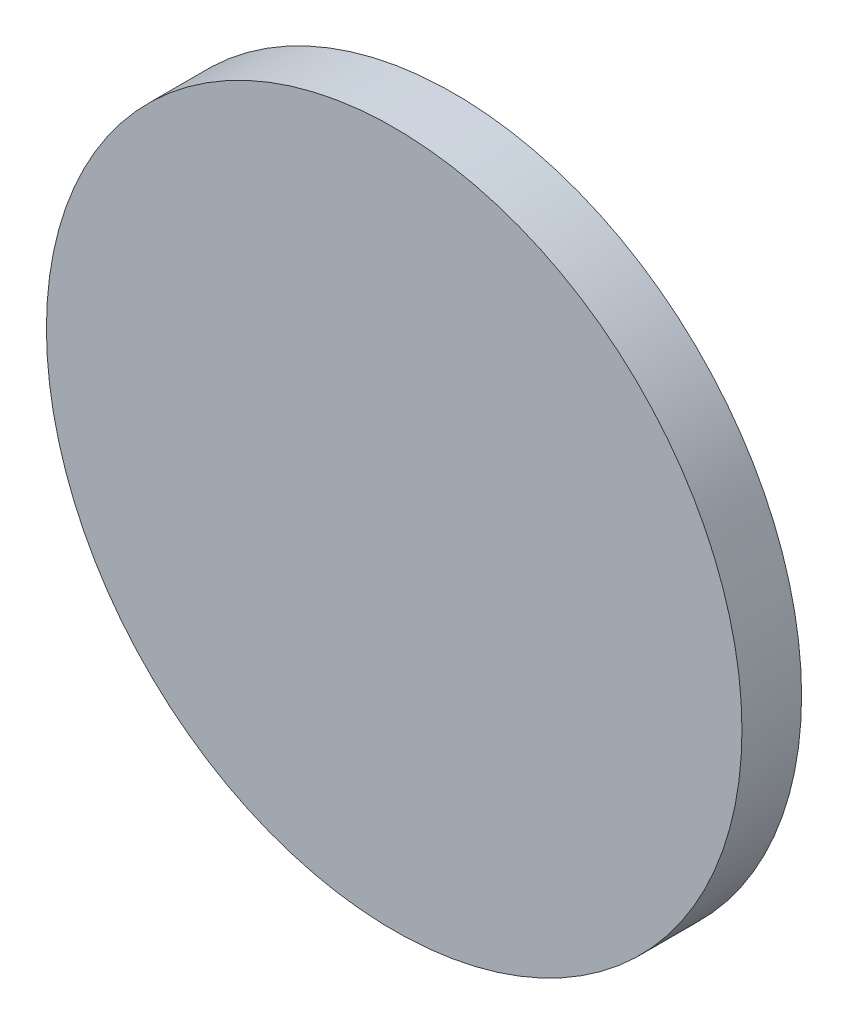
ISO-10303-21;
HEADER;
FILE_DESCRIPTION(('STEP AP214'),'2;1');
FILE_NAME('part.step','',(''),(''),'','','');
FILE_SCHEMA(('AUTOMOTIVE_DESIGN { 1 0 10303 214 1 1 1 1 }'));
ENDSEC;
DATA;
#1=APPLICATION_CONTEXT('core data for automotive mechanical design processes');
#2=APPLICATION_PROTOCOL_DEFINITION('international standard','automotive_design',2000,#1);
#3=PRODUCT_CONTEXT('',#1,'mechanical');
#4=PRODUCT('Part','Part','',(#3));
#5=PRODUCT_RELATED_PRODUCT_CATEGORY('part','',(#4));
#6=PRODUCT_DEFINITION_FORMATION('','',#4);
#7=PRODUCT_DEFINITION_CONTEXT('part definition',#1,'design');
#8=PRODUCT_DEFINITION('design','',#6,#7);
#9=PRODUCT_DEFINITION_SHAPE('','',#8);
#10=(LENGTH_UNIT() NAMED_UNIT(*) SI_UNIT(.MILLI.,.METRE.));
#11=(NAMED_UNIT(*) PLANE_ANGLE_UNIT() SI_UNIT($,.RADIAN.));
#12=(NAMED_UNIT(*) SI_UNIT($,.STERADIAN.) SOLID_ANGLE_UNIT());
#13=UNCERTAINTY_MEASURE_WITH_UNIT(LENGTH_MEASURE(1.E-05),#10,'distance_accuracy_value','');
#14=(GEOMETRIC_REPRESENTATION_CONTEXT(3) GLOBAL_UNCERTAINTY_ASSIGNED_CONTEXT((#13)) GLOBAL_UNIT_ASSIGNED_CONTEXT((#10,
#11,#12)) REPRESENTATION_CONTEXT('',''));
#15=CARTESIAN_POINT('',(0.,0.,0.));
#16=DIRECTION('',(0.,0.,1.));
#17=DIRECTION('',(1.,0.,0.));
#18=AXIS2_PLACEMENT_3D('',#15,#16,#17);
#19=CARTESIAN_POINT('',(11.595,2.386000014875,0.03429));
#20=DIRECTION('',(0.,0.,1.));
#21=DIRECTION('',(1.,0.,0.));
#22=AXIS2_PLACEMENT_3D('',#19,#20,#21);
#23=PLANE('',#22);
#24=CARTESIAN_POINT('',(11.595,2.386000014875,0.03429));
#25=DIRECTION('',(0.,0.,1.));
#26=DIRECTION('',(1.,0.,0.));
#27=AXIS2_PLACEMENT_3D('',#24,#25,#26);
#28=CIRCLE('',#27,0.200024667);
#29=CARTESIAN_POINT('',(11.795024667,2.386000014875,0.03429));
#30=VERTEX_POINT('',#29);
#31=EDGE_CURVE('E18',#30,#30,#28,.F.);
#32=ORIENTED_EDGE('',*,*,#31,.F.);
#33=EDGE_LOOP('',(#32));
#34=FACE_BOUND('',#33,.T.);
#35=ADVANCED_FACE('F15',(#34),#23,.T.);
#36=CARTESIAN_POINT('',(11.595,2.386000014875,0.));
#37=DIRECTION('',(0.,0.,1.));
#38=DIRECTION('',(1.,0.,0.));
#39=AXIS2_PLACEMENT_3D('',#36,#37,#38);
#40=CYLINDRICAL_SURFACE('',#39,0.200024667);
#41=ORIENTED_EDGE('',*,*,#31,.T.);
#42=EDGE_LOOP('',(#41));
#43=FACE_BOUND('',#42,.T.);
#44=CARTESIAN_POINT('',(11.595,2.386000014875,0.));
#45=DIRECTION('',(0.,0.,1.));
#46=DIRECTION('',(1.,0.,0.));
#47=AXIS2_PLACEMENT_3D('',#44,#45,#46);
#48=CIRCLE('',#47,0.200024667);
#49=CARTESIAN_POINT('',(11.795024667,2.386000014875,0.));
#50=VERTEX_POINT('',#49);
#51=EDGE_CURVE('E10',#50,#50,#48,.F.);
#52=ORIENTED_EDGE('',*,*,#51,.F.);
#53=EDGE_LOOP('',(#52));
#54=FACE_BOUND('',#53,.T.);
#55=ADVANCED_FACE('F27',(#43,#54),#40,.T.);
#56=CARTESIAN_POINT('',(11.595,2.386000014875,0.));
#57=DIRECTION('',(0.,0.,-1.));
#58=DIRECTION('',(-1.,0.,0.));
#59=AXIS2_PLACEMENT_3D('',#56,#57,#58);
#60=PLANE('',#59);
#61=ORIENTED_EDGE('',*,*,#51,.T.);
#62=EDGE_LOOP('',(#61));
#63=FACE_BOUND('',#62,.T.);
#64=ADVANCED_FACE('F35',(#63),#60,.T.);
#65=CLOSED_SHELL('',(#35,#55,#64));
#66=MANIFOLD_SOLID_BREP('B1',#65);
#67=ADVANCED_BREP_SHAPE_REPRESENTATION('',(#18,#66),#14);
#68=SHAPE_DEFINITION_REPRESENTATION(#9,#67);
ENDSEC;
END-ISO-10303-21;
